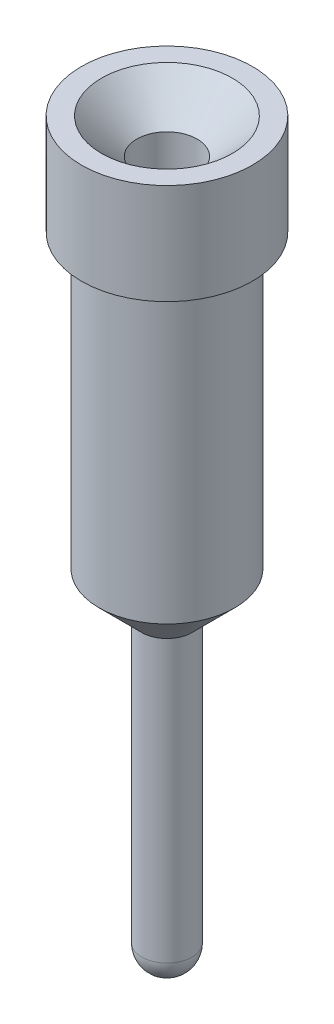
ISO-10303-21;
HEADER;
FILE_DESCRIPTION(('STEP AP214'),'2;1');
FILE_NAME('part.step','',(''),(''),'','','');
FILE_SCHEMA(('AUTOMOTIVE_DESIGN { 1 0 10303 214 1 1 1 1 }'));
ENDSEC;
DATA;
#1=APPLICATION_CONTEXT('core data for automotive mechanical design processes');
#2=APPLICATION_PROTOCOL_DEFINITION('international standard','automotive_design',2000,#1);
#3=PRODUCT_CONTEXT('',#1,'mechanical');
#4=PRODUCT('Part','Part','',(#3));
#5=PRODUCT_RELATED_PRODUCT_CATEGORY('part','',(#4));
#6=PRODUCT_DEFINITION_FORMATION('','',#4);
#7=PRODUCT_DEFINITION_CONTEXT('part definition',#1,'design');
#8=PRODUCT_DEFINITION('design','',#6,#7);
#9=PRODUCT_DEFINITION_SHAPE('','',#8);
#10=(LENGTH_UNIT() NAMED_UNIT(*) SI_UNIT(.MILLI.,.METRE.));
#11=(NAMED_UNIT(*) PLANE_ANGLE_UNIT() SI_UNIT($,.RADIAN.));
#12=(NAMED_UNIT(*) SI_UNIT($,.STERADIAN.) SOLID_ANGLE_UNIT());
#13=UNCERTAINTY_MEASURE_WITH_UNIT(LENGTH_MEASURE(1.E-05),#10,'distance_accuracy_value','');
#14=(GEOMETRIC_REPRESENTATION_CONTEXT(3) GLOBAL_UNCERTAINTY_ASSIGNED_CONTEXT((#13)) GLOBAL_UNIT_ASSIGNED_CONTEXT((#10,
#11,#12)) REPRESENTATION_CONTEXT('',''));
#15=CARTESIAN_POINT('',(0.,0.,0.));
#16=DIRECTION('',(0.,0.,1.));
#17=DIRECTION('',(1.,0.,0.));
#18=AXIS2_PLACEMENT_3D('',#15,#16,#17);
#19=CARTESIAN_POINT('',(-0.849999999999997,0.,0.));
#20=DIRECTION('',(0.,1.,0.));
#21=DIRECTION('',(0.,0.,1.));
#22=AXIS2_PLACEMENT_3D('',#19,#20,#21);
#23=PLANE('',#22);
#24=CARTESIAN_POINT('',(0.,0.,0.));
#25=DIRECTION('',(0.,1.,0.));
#26=DIRECTION('',(0.,0.,1.));
#27=AXIS2_PLACEMENT_3D('',#24,#25,#26);
#28=CIRCLE('',#27,0.849999999999997);
#29=CARTESIAN_POINT('',(0.,0.,0.849999999999997));
#30=VERTEX_POINT('',#29);
#31=EDGE_CURVE('E11',#30,#30,#28,.T.);
#32=ORIENTED_EDGE('',*,*,#31,.T.);
#33=EDGE_LOOP('',(#32));
#34=FACE_BOUND('',#33,.T.);
#35=CARTESIAN_POINT('',(0.,0.,0.));
#36=DIRECTION('',(0.,1.,0.));
#37=DIRECTION('',(0.,0.,1.));
#38=AXIS2_PLACEMENT_3D('',#35,#36,#37);
#39=CIRCLE('',#38,0.649999999999995);
#40=CARTESIAN_POINT('',(0.,0.,0.649999999999995));
#41=VERTEX_POINT('',#40);
#42=EDGE_CURVE('E72',#41,#41,#39,.T.);
#43=ORIENTED_EDGE('',*,*,#42,.F.);
#44=EDGE_LOOP('',(#43));
#45=FACE_BOUND('',#44,.T.);
#46=ADVANCED_FACE('F34',(#34,#45),#23,.T.);
#47=CARTESIAN_POINT('',(0.,28.992562867327,0.));
#48=DIRECTION('',(0.,1.,0.));
#49=DIRECTION('',(0.,0.,1.));
#50=AXIS2_PLACEMENT_3D('',#47,#48,#49);
#51=CYLINDRICAL_SURFACE('',#50,0.849999999999996);
#52=CARTESIAN_POINT('',(0.,-1.,0.));
#53=DIRECTION('',(0.,1.,0.));
#54=DIRECTION('',(0.,0.,1.));
#55=AXIS2_PLACEMENT_3D('',#52,#53,#54);
#56=CIRCLE('',#55,0.849999999999996);
#57=CARTESIAN_POINT('',(0.,-1.,0.849999999999996));
#58=VERTEX_POINT('',#57);
#59=EDGE_CURVE('E40',#58,#58,#56,.T.);
#60=ORIENTED_EDGE('',*,*,#59,.T.);
#61=EDGE_LOOP('',(#60));
#62=FACE_BOUND('',#61,.T.);
#63=ORIENTED_EDGE('',*,*,#31,.F.);
#64=EDGE_LOOP('',(#63));
#65=FACE_BOUND('',#64,.T.);
#66=ADVANCED_FACE('F61',(#62,#65),#51,.T.);
#67=CARTESIAN_POINT('',(-0.849999999999996,-0.999999999999999,0.));
#68=DIRECTION('',(0.,-1.,0.));
#69=DIRECTION('',(0.,0.,-1.));
#70=AXIS2_PLACEMENT_3D('',#67,#68,#69);
#71=PLANE('',#70);
#72=CARTESIAN_POINT('',(0.,-1.,0.));
#73=DIRECTION('',(0.,1.,0.));
#74=DIRECTION('',(0.,0.,1.));
#75=AXIS2_PLACEMENT_3D('',#72,#73,#74);
#76=CIRCLE('',#75,0.674999999999996);
#77=CARTESIAN_POINT('',(0.,-1.,0.674999999999996));
#78=VERTEX_POINT('',#77);
#79=EDGE_CURVE('E90',#78,#78,#76,.T.);
#80=ORIENTED_EDGE('',*,*,#79,.T.);
#81=EDGE_LOOP('',(#80));
#82=FACE_BOUND('',#81,.T.);
#83=ORIENTED_EDGE('',*,*,#59,.F.);
#84=EDGE_LOOP('',(#83));
#85=FACE_BOUND('',#84,.T.);
#86=ADVANCED_FACE('F66',(#82,#85),#71,.T.);
#87=CARTESIAN_POINT('',(0.,28.992562867327,0.));
#88=DIRECTION('',(0.,1.,0.));
#89=DIRECTION('',(0.,0.,1.));
#90=AXIS2_PLACEMENT_3D('',#87,#88,#89);
#91=CYLINDRICAL_SURFACE('',#90,0.674999999999996);
#92=CARTESIAN_POINT('',(0.,-3.9,0.));
#93=DIRECTION('',(0.,1.,0.));
#94=DIRECTION('',(0.,0.,1.));
#95=AXIS2_PLACEMENT_3D('',#92,#93,#94);
#96=CIRCLE('',#95,0.674999999999995);
#97=CARTESIAN_POINT('',(0.,-3.9,0.674999999999995));
#98=VERTEX_POINT('',#97);
#99=EDGE_CURVE('E87',#98,#98,#96,.T.);
#100=ORIENTED_EDGE('',*,*,#99,.T.);
#101=EDGE_LOOP('',(#100));
#102=FACE_BOUND('',#101,.T.);
#103=ORIENTED_EDGE('',*,*,#79,.F.);
#104=EDGE_LOOP('',(#103));
#105=FACE_BOUND('',#104,.T.);
#106=ADVANCED_FACE('F97',(#102,#105),#91,.T.);
#107=CARTESIAN_POINT('',(0.,-3.9,0.));
#108=DIRECTION('',(0.,1.,0.));
#109=DIRECTION('',(0.,0.,1.));
#110=AXIS2_PLACEMENT_3D('',#107,#108,#109);
#111=CONICAL_SURFACE('',#110,0.674999999999995,0.785398163397453);
#112=CARTESIAN_POINT('',(0.,-4.325,0.));
#113=DIRECTION('',(0.,1.,0.));
#114=DIRECTION('',(0.,0.,1.));
#115=AXIS2_PLACEMENT_3D('',#112,#113,#114);
#116=CIRCLE('',#115,0.249999999999996);
#117=CARTESIAN_POINT('',(0.,-4.325,0.249999999999996));
#118=VERTEX_POINT('',#117);
#119=EDGE_CURVE('E84',#118,#118,#116,.T.);
#120=ORIENTED_EDGE('',*,*,#119,.T.);
#121=EDGE_LOOP('',(#120));
#122=FACE_BOUND('',#121,.T.);
#123=ORIENTED_EDGE('',*,*,#99,.F.);
#124=EDGE_LOOP('',(#123));
#125=FACE_BOUND('',#124,.T.);
#126=ADVANCED_FACE('F103',(#122,#125),#111,.T.);
#127=CARTESIAN_POINT('',(0.,28.992562867327,0.));
#128=DIRECTION('',(0.,1.,0.));
#129=DIRECTION('',(0.,0.,1.));
#130=AXIS2_PLACEMENT_3D('',#127,#128,#129);
#131=CYLINDRICAL_SURFACE('',#130,0.249999999999996);
#132=CARTESIAN_POINT('',(0.,-7.12,0.));
#133=DIRECTION('',(0.,1.,0.));
#134=DIRECTION('',(0.,0.,1.));
#135=AXIS2_PLACEMENT_3D('',#132,#133,#134);
#136=CIRCLE('',#135,0.249999999999996);
#137=CARTESIAN_POINT('',(0.,-7.12,0.249999999999996));
#138=VERTEX_POINT('',#137);
#139=EDGE_CURVE('E81',#138,#138,#136,.T.);
#140=ORIENTED_EDGE('',*,*,#139,.T.);
#141=EDGE_LOOP('',(#140));
#142=FACE_BOUND('',#141,.T.);
#143=ORIENTED_EDGE('',*,*,#119,.F.);
#144=EDGE_LOOP('',(#143));
#145=FACE_BOUND('',#144,.T.);
#146=ADVANCED_FACE('F56',(#142,#145),#131,.T.);
#147=CARTESIAN_POINT('',(0.,-7.12,0.));
#148=DIRECTION('',(0.,1.,0.));
#149=DIRECTION('',(-1.,0.,0.));
#150=AXIS2_PLACEMENT_3D('',#147,#148,#149);
#151=SPHERICAL_SURFACE('',#150,0.249999999999996);
#152=ORIENTED_EDGE('',*,*,#139,.F.);
#153=EDGE_LOOP('',(#152));
#154=FACE_BOUND('',#153,.T.);
#155=ADVANCED_FACE('F46',(#154),#151,.T.);
#156=CARTESIAN_POINT('',(0.,-4.,0.));
#157=DIRECTION('',(0.,1.,0.));
#158=DIRECTION('',(0.,0.,1.));
#159=AXIS2_PLACEMENT_3D('',#156,#157,#158);
#160=CONICAL_SURFACE('',#159,0.,0.785398163397442);
#161=CARTESIAN_POINT('',(0.,-3.7,0.));
#162=DIRECTION('',(0.,1.,0.));
#163=DIRECTION('',(0.,0.,1.));
#164=AXIS2_PLACEMENT_3D('',#161,#162,#163);
#165=CIRCLE('',#164,0.299999999999995);
#166=CARTESIAN_POINT('',(0.,-3.7,0.299999999999995));
#167=VERTEX_POINT('',#166);
#168=EDGE_CURVE('E77',#167,#167,#165,.T.);
#169=ORIENTED_EDGE('',*,*,#168,.T.);
#170=EDGE_LOOP('',(#169));
#171=FACE_BOUND('',#170,.T.);
#172=CARTESIAN_POINT('',(0.,-4.,0.));
#173=VERTEX_POINT('',#172);
#174=VERTEX_LOOP('',#173);
#175=FACE_BOUND('',#174,.T.);
#176=ADVANCED_FACE('F43',(#171,#175),#160,.F.);
#177=CARTESIAN_POINT('',(0.,28.992562867327,0.));
#178=DIRECTION('',(0.,1.,0.));
#179=DIRECTION('',(0.,0.,1.));
#180=AXIS2_PLACEMENT_3D('',#177,#178,#179);
#181=CYLINDRICAL_SURFACE('',#180,0.299999999999996);
#182=CARTESIAN_POINT('',(0.,-0.35,0.));
#183=DIRECTION('',(0.,1.,0.));
#184=DIRECTION('',(0.,0.,1.));
#185=AXIS2_PLACEMENT_3D('',#182,#183,#184);
#186=CIRCLE('',#185,0.299999999999996);
#187=CARTESIAN_POINT('',(0.,-0.35,0.299999999999996));
#188=VERTEX_POINT('',#187);
#189=EDGE_CURVE('E74',#188,#188,#186,.T.);
#190=ORIENTED_EDGE('',*,*,#189,.T.);
#191=EDGE_LOOP('',(#190));
#192=FACE_BOUND('',#191,.T.);
#193=ORIENTED_EDGE('',*,*,#168,.F.);
#194=EDGE_LOOP('',(#193));
#195=FACE_BOUND('',#194,.T.);
#196=ADVANCED_FACE('F45',(#192,#195),#181,.F.);
#197=CARTESIAN_POINT('',(0.,-0.35,0.));
#198=DIRECTION('',(0.,1.,0.));
#199=DIRECTION('',(0.,0.,1.));
#200=AXIS2_PLACEMENT_3D('',#197,#198,#199);
#201=CONICAL_SURFACE('',#200,0.299999999999996,0.785398163397447);
#202=ORIENTED_EDGE('',*,*,#42,.T.);
#203=EDGE_LOOP('',(#202));
#204=FACE_BOUND('',#203,.T.);
#205=ORIENTED_EDGE('',*,*,#189,.F.);
#206=EDGE_LOOP('',(#205));
#207=FACE_BOUND('',#206,.T.);
#208=ADVANCED_FACE('F53',(#204,#207),#201,.F.);
#209=CLOSED_SHELL('',(#46,#66,#86,#106,#126,#146,#155,#176,#196,#208));
#210=MANIFOLD_SOLID_BREP('B2',#209);
#211=ADVANCED_BREP_SHAPE_REPRESENTATION('',(#18,#210),#14);
#212=SHAPE_DEFINITION_REPRESENTATION(#9,#211);
ENDSEC;
END-ISO-10303-21;
